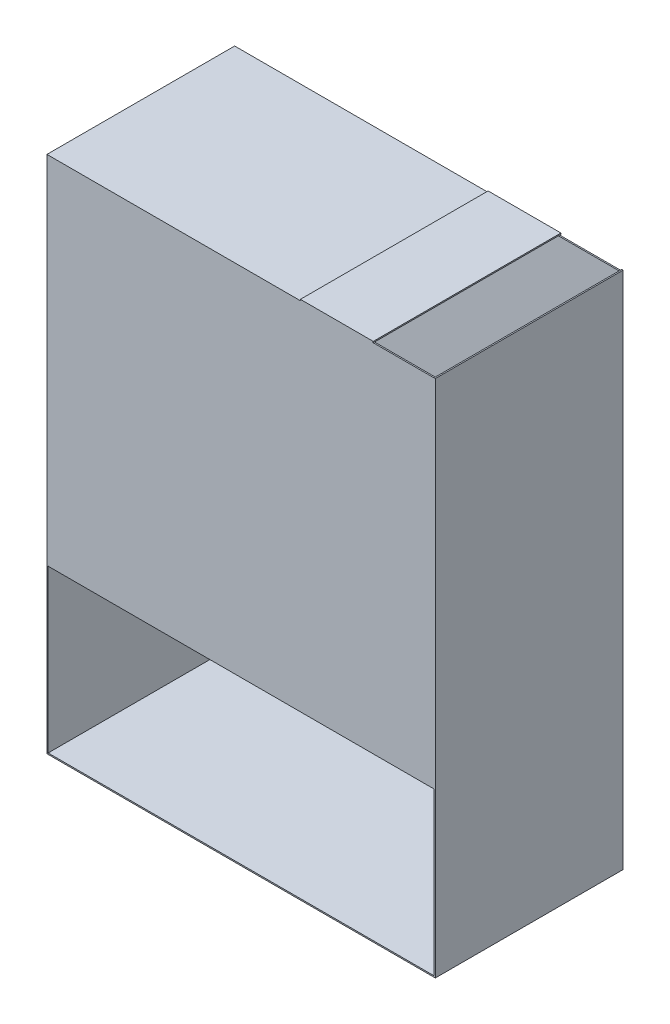
ISO-10303-21;
HEADER;
FILE_DESCRIPTION(('STEP AP214'),'2;1');
FILE_NAME('part.step','',(''),(''),'','','');
FILE_SCHEMA(('AUTOMOTIVE_DESIGN { 1 0 10303 214 1 1 1 1 }'));
ENDSEC;
DATA;
#1=APPLICATION_CONTEXT('core data for automotive mechanical design processes');
#2=APPLICATION_PROTOCOL_DEFINITION('international standard','automotive_design',2000,#1);
#3=PRODUCT_CONTEXT('',#1,'mechanical');
#4=PRODUCT('Part','Part','',(#3));
#5=PRODUCT_RELATED_PRODUCT_CATEGORY('part','',(#4));
#6=PRODUCT_DEFINITION_FORMATION('','',#4);
#7=PRODUCT_DEFINITION_CONTEXT('part definition',#1,'design');
#8=PRODUCT_DEFINITION('design','',#6,#7);
#9=PRODUCT_DEFINITION_SHAPE('','',#8);
#10=(LENGTH_UNIT() NAMED_UNIT(*) SI_UNIT(.MILLI.,.METRE.));
#11=(NAMED_UNIT(*) PLANE_ANGLE_UNIT() SI_UNIT($,.RADIAN.));
#12=(NAMED_UNIT(*) SI_UNIT($,.STERADIAN.) SOLID_ANGLE_UNIT());
#13=UNCERTAINTY_MEASURE_WITH_UNIT(LENGTH_MEASURE(1.E-05),#10,'distance_accuracy_value','');
#14=(GEOMETRIC_REPRESENTATION_CONTEXT(3) GLOBAL_UNCERTAINTY_ASSIGNED_CONTEXT((#13)) GLOBAL_UNIT_ASSIGNED_CONTEXT((#10,
#11,#12)) REPRESENTATION_CONTEXT('',''));
#15=CARTESIAN_POINT('',(0.,0.,0.));
#16=DIRECTION('',(0.,0.,1.));
#17=DIRECTION('',(1.,0.,0.));
#18=AXIS2_PLACEMENT_3D('',#15,#16,#17);
#19=CARTESIAN_POINT('',(598.,2.,290.));
#20=DIRECTION('',(1.,0.,0.));
#21=DIRECTION('',(0.,0.,-1.));
#22=AXIS2_PLACEMENT_3D('',#19,#20,#21);
#23=PLANE('',#22);
#24=DIRECTION('',(0.,0.,1.));
#25=VECTOR('',#24,1.);
#26=CARTESIAN_POINT('',(598.,251.875465041945,290.));
#27=LINE('',#26,#25);
#28=CARTESIAN_POINT('',(598.,251.875465041945,288.));
#29=VERTEX_POINT('',#28);
#30=CARTESIAN_POINT('',(598.,251.875465041945,290.));
#31=VERTEX_POINT('',#30);
#32=EDGE_CURVE('E185',#29,#31,#27,.T.);
#33=ORIENTED_EDGE('',*,*,#32,.F.);
#34=DIRECTION('',(0.,1.,0.));
#35=VECTOR('',#34,1.);
#36=CARTESIAN_POINT('',(598.,2.,288.));
#37=LINE('',#36,#35);
#38=CARTESIAN_POINT('',(598.,801.875465041945,288.));
#39=VERTEX_POINT('',#38);
#40=EDGE_CURVE('E178',#29,#39,#37,.T.);
#41=ORIENTED_EDGE('',*,*,#40,.T.);
#42=DIRECTION('',(0.,0.,1.));
#43=VECTOR('',#42,1.);
#44=CARTESIAN_POINT('',(598.,801.875465041945,290.));
#45=LINE('',#44,#43);
#46=CARTESIAN_POINT('',(598.,801.875465041945,290.));
#47=VERTEX_POINT('',#46);
#48=EDGE_CURVE('E164',#39,#47,#45,.T.);
#49=ORIENTED_EDGE('',*,*,#48,.T.);
#50=DIRECTION('',(0.,-1.,0.));
#51=VECTOR('',#50,1.);
#52=CARTESIAN_POINT('',(598.,2.,290.));
#53=LINE('',#52,#51);
#54=CARTESIAN_POINT('',(598.,802.,290.));
#55=VERTEX_POINT('',#54);
#56=EDGE_CURVE('E222',#55,#47,#53,.T.);
#57=ORIENTED_EDGE('',*,*,#56,.F.);
#58=DIRECTION('',(0.,0.,-1.));
#59=VECTOR('',#58,1.);
#60=CARTESIAN_POINT('',(598.,802.,290.));
#61=LINE('',#60,#59);
#62=CARTESIAN_POINT('',(598.,802.,0.));
#63=VERTEX_POINT('',#62);
#64=EDGE_CURVE('E288',#55,#63,#61,.T.);
#65=ORIENTED_EDGE('',*,*,#64,.T.);
#66=DIRECTION('',(0.,-1.,0.));
#67=VECTOR('',#66,1.);
#68=CARTESIAN_POINT('',(598.,2.,0.));
#69=LINE('',#68,#67);
#70=CARTESIAN_POINT('',(598.,800.,0.));
#71=VERTEX_POINT('',#70);
#72=EDGE_CURVE('E243',#63,#71,#69,.T.);
#73=ORIENTED_EDGE('',*,*,#72,.T.);
#74=DIRECTION('',(0.,0.,-1.));
#75=VECTOR('',#74,1.);
#76=CARTESIAN_POINT('',(598.,800.,0.));
#77=LINE('',#76,#75);
#78=CARTESIAN_POINT('',(598.,800.,2.));
#79=VERTEX_POINT('',#78);
#80=EDGE_CURVE('E59',#79,#71,#77,.T.);
#81=ORIENTED_EDGE('',*,*,#80,.F.);
#82=DIRECTION('',(0.,-1.,0.));
#83=VECTOR('',#82,1.);
#84=CARTESIAN_POINT('',(598.,800.,2.));
#85=LINE('',#84,#83);
#86=CARTESIAN_POINT('',(598.,2.,2.));
#87=VERTEX_POINT('',#86);
#88=EDGE_CURVE('E200',#79,#87,#85,.T.);
#89=ORIENTED_EDGE('',*,*,#88,.T.);
#90=DIRECTION('',(0.,0.,-1.));
#91=VECTOR('',#90,1.);
#92=CARTESIAN_POINT('',(598.,2.,290.));
#93=LINE('',#92,#91);
#94=CARTESIAN_POINT('',(598.,2.,290.));
#95=VERTEX_POINT('',#94);
#96=EDGE_CURVE('E285',#95,#87,#93,.T.);
#97=ORIENTED_EDGE('',*,*,#96,.F.);
#98=EDGE_CURVE('E221',#31,#95,#53,.T.);
#99=ORIENTED_EDGE('',*,*,#98,.F.);
#100=EDGE_LOOP('',(#33,#41,#49,#57,#65,#73,#81,#89,#97,#99));
#101=FACE_BOUND('',#100,.T.);
#102=ADVANCED_FACE('F36',(#101),#23,.F.);
#103=CARTESIAN_POINT('',(1.87546504194518,2.,290.));
#104=DIRECTION('',(0.,-1.,0.));
#105=DIRECTION('',(0.,0.,-1.));
#106=AXIS2_PLACEMENT_3D('',#103,#104,#105);
#107=PLANE('',#106);
#108=DIRECTION('',(1.,0.,0.));
#109=VECTOR('',#108,1.);
#110=CARTESIAN_POINT('',(1.87546504194518,2.,2.));
#111=LINE('',#110,#109);
#112=CARTESIAN_POINT('',(1.87546504194518,2.,2.));
#113=VERTEX_POINT('',#112);
#114=EDGE_CURVE('E208',#113,#87,#111,.T.);
#115=ORIENTED_EDGE('',*,*,#114,.F.);
#116=DIRECTION('',(0.,0.,-1.));
#117=VECTOR('',#116,1.);
#118=CARTESIAN_POINT('',(1.87546504194518,2.,290.));
#119=LINE('',#118,#117);
#120=CARTESIAN_POINT('',(1.87546504194518,2.,290.));
#121=VERTEX_POINT('',#120);
#122=EDGE_CURVE('E282',#121,#113,#119,.T.);
#123=ORIENTED_EDGE('',*,*,#122,.F.);
#124=DIRECTION('',(-1.,0.,0.));
#125=VECTOR('',#124,1.);
#126=CARTESIAN_POINT('',(1.87546504194518,2.,290.));
#127=LINE('',#126,#125);
#128=EDGE_CURVE('E224',#95,#121,#127,.T.);
#129=ORIENTED_EDGE('',*,*,#128,.F.);
#130=ORIENTED_EDGE('',*,*,#96,.T.);
#131=EDGE_LOOP('',(#115,#123,#129,#130));
#132=FACE_BOUND('',#131,.T.);
#133=ADVANCED_FACE('F357',(#132),#107,.F.);
#134=CARTESIAN_POINT('',(1.87546504194518,2.,290.));
#135=DIRECTION('',(-1.,0.,0.));
#136=DIRECTION('',(0.,0.,1.));
#137=AXIS2_PLACEMENT_3D('',#134,#135,#136);
#138=PLANE('',#137);
#139=DIRECTION('',(0.,0.,-1.));
#140=VECTOR('',#139,1.);
#141=CARTESIAN_POINT('',(1.87546504194518,800.,290.));
#142=LINE('',#141,#140);
#143=CARTESIAN_POINT('',(1.87546504194518,800.,288.));
#144=VERTEX_POINT('',#143);
#145=CARTESIAN_POINT('',(1.87546504194518,800.,2.));
#146=VERTEX_POINT('',#145);
#147=EDGE_CURVE('E280',#144,#146,#142,.T.);
#148=ORIENTED_EDGE('',*,*,#147,.F.);
#149=DIRECTION('',(0.,-1.,0.));
#150=VECTOR('',#149,1.);
#151=CARTESIAN_POINT('',(1.87546504194518,2.,288.));
#152=LINE('',#151,#150);
#153=CARTESIAN_POINT('',(1.87546504194518,251.875465041945,288.));
#154=VERTEX_POINT('',#153);
#155=EDGE_CURVE('E187',#144,#154,#152,.T.);
#156=ORIENTED_EDGE('',*,*,#155,.T.);
#157=DIRECTION('',(0.,0.,-1.));
#158=VECTOR('',#157,1.);
#159=CARTESIAN_POINT('',(1.87546504194518,251.875465041945,290.));
#160=LINE('',#159,#158);
#161=CARTESIAN_POINT('',(1.87546504194518,251.875465041945,290.));
#162=VERTEX_POINT('',#161);
#163=EDGE_CURVE('E172',#162,#154,#160,.T.);
#164=ORIENTED_EDGE('',*,*,#163,.F.);
#165=DIRECTION('',(0.,1.,0.));
#166=VECTOR('',#165,1.);
#167=CARTESIAN_POINT('',(1.87546504194518,2.,290.));
#168=LINE('',#167,#166);
#169=EDGE_CURVE('E226',#121,#162,#168,.T.);
#170=ORIENTED_EDGE('',*,*,#169,.F.);
#171=ORIENTED_EDGE('',*,*,#122,.T.);
#172=DIRECTION('',(0.,-1.,0.));
#173=VECTOR('',#172,1.);
#174=CARTESIAN_POINT('',(1.87546504194518,2.,2.));
#175=LINE('',#174,#173);
#176=EDGE_CURVE('E205',#146,#113,#175,.T.);
#177=ORIENTED_EDGE('',*,*,#176,.F.);
#178=EDGE_LOOP('',(#148,#156,#164,#170,#171,#177));
#179=FACE_BOUND('',#178,.T.);
#180=ADVANCED_FACE('F380',(#179),#138,.F.);
#181=CARTESIAN_POINT('',(1.87546504194518,800.,290.));
#182=DIRECTION('',(0.,1.,0.));
#183=DIRECTION('',(-1.,0.,0.));
#184=AXIS2_PLACEMENT_3D('',#181,#182,#183);
#185=PLANE('',#184);
#186=DIRECTION('',(0.,0.,-1.));
#187=VECTOR('',#186,1.);
#188=CARTESIAN_POINT('',(451.987075108766,800.,290.));
#189=LINE('',#188,#187);
#190=CARTESIAN_POINT('',(451.987075108766,800.,288.));
#191=VERTEX_POINT('',#190);
#192=CARTESIAN_POINT('',(451.987075108766,800.,2.));
#193=VERTEX_POINT('',#192);
#194=EDGE_CURVE('E278',#191,#193,#189,.T.);
#195=ORIENTED_EDGE('',*,*,#194,.F.);
#196=DIRECTION('',(-1.,0.,0.));
#197=VECTOR('',#196,1.);
#198=CARTESIAN_POINT('',(1.87546504194518,800.,288.));
#199=LINE('',#198,#197);
#200=EDGE_CURVE('E192',#191,#144,#199,.T.);
#201=ORIENTED_EDGE('',*,*,#200,.T.);
#202=ORIENTED_EDGE('',*,*,#147,.T.);
#203=DIRECTION('',(1.,0.,0.));
#204=VECTOR('',#203,1.);
#205=CARTESIAN_POINT('',(0.,800.,2.));
#206=LINE('',#205,#204);
#207=EDGE_CURVE('E189',#146,#193,#206,.T.);
#208=ORIENTED_EDGE('',*,*,#207,.T.);
#209=EDGE_LOOP('',(#195,#201,#202,#208));
#210=FACE_BOUND('',#209,.T.);
#211=ADVANCED_FACE('F376',(#210),#185,.F.);
#212=CARTESIAN_POINT('',(0.,0.,290.));
#213=DIRECTION('',(0.,1.,0.));
#214=DIRECTION('',(0.,0.,1.));
#215=AXIS2_PLACEMENT_3D('',#212,#213,#214);
#216=PLANE('',#215);
#217=DIRECTION('',(0.,0.,-1.));
#218=VECTOR('',#217,1.);
#219=CARTESIAN_POINT('',(0.,0.,290.));
#220=LINE('',#219,#218);
#221=CARTESIAN_POINT('',(0.,0.,290.));
#222=VERTEX_POINT('',#221);
#223=CARTESIAN_POINT('',(0.,0.,0.));
#224=VERTEX_POINT('',#223);
#225=EDGE_CURVE('E11',#222,#224,#220,.T.);
#226=ORIENTED_EDGE('',*,*,#225,.T.);
#227=DIRECTION('',(1.,0.,0.));
#228=VECTOR('',#227,1.);
#229=CARTESIAN_POINT('',(0.,0.,0.));
#230=LINE('',#229,#228);
#231=CARTESIAN_POINT('',(600.,0.,0.));
#232=VERTEX_POINT('',#231);
#233=EDGE_CURVE('E211',#224,#232,#230,.T.);
#234=ORIENTED_EDGE('',*,*,#233,.T.);
#235=DIRECTION('',(0.,0.,-1.));
#236=VECTOR('',#235,1.);
#237=CARTESIAN_POINT('',(600.,0.,290.));
#238=LINE('',#237,#236);
#239=CARTESIAN_POINT('',(600.,0.,290.));
#240=VERTEX_POINT('',#239);
#241=EDGE_CURVE('E44',#240,#232,#238,.T.);
#242=ORIENTED_EDGE('',*,*,#241,.F.);
#243=DIRECTION('',(1.,0.,0.));
#244=VECTOR('',#243,1.);
#245=CARTESIAN_POINT('',(0.,0.,290.));
#246=LINE('',#245,#244);
#247=EDGE_CURVE('E214',#222,#240,#246,.T.);
#248=ORIENTED_EDGE('',*,*,#247,.F.);
#249=EDGE_LOOP('',(#226,#234,#242,#248));
#250=FACE_BOUND('',#249,.T.);
#251=ADVANCED_FACE('F38',(#250),#216,.F.);
#252=CARTESIAN_POINT('',(600.,1.87180692093034,290.));
#253=DIRECTION('',(-1.,0.,0.));
#254=DIRECTION('',(0.,0.,1.));
#255=AXIS2_PLACEMENT_3D('',#252,#253,#254);
#256=PLANE('',#255);
#257=DIRECTION('',(0.,0.,-1.));
#258=VECTOR('',#257,1.);
#259=CARTESIAN_POINT('',(600.,802.,290.));
#260=LINE('',#259,#258);
#261=CARTESIAN_POINT('',(600.,802.,290.));
#262=VERTEX_POINT('',#261);
#263=CARTESIAN_POINT('',(600.,802.,0.));
#264=VERTEX_POINT('',#263);
#265=EDGE_CURVE('E291',#262,#264,#260,.T.);
#266=ORIENTED_EDGE('',*,*,#265,.F.);
#267=DIRECTION('',(0.,1.,0.));
#268=VECTOR('',#267,1.);
#269=CARTESIAN_POINT('',(600.,0.,290.));
#270=LINE('',#269,#268);
#271=EDGE_CURVE('E217',#240,#262,#270,.T.);
#272=ORIENTED_EDGE('',*,*,#271,.F.);
#273=ORIENTED_EDGE('',*,*,#241,.T.);
#274=DIRECTION('',(0.,1.,0.));
#275=VECTOR('',#274,1.);
#276=CARTESIAN_POINT('',(600.,1.87180692093034,0.));
#277=LINE('',#276,#275);
#278=EDGE_CURVE('E239',#232,#264,#277,.T.);
#279=ORIENTED_EDGE('',*,*,#278,.T.);
#280=EDGE_LOOP('',(#266,#272,#273,#279));
#281=FACE_BOUND('',#280,.T.);
#282=ADVANCED_FACE('F298',(#281),#256,.F.);
#283=CARTESIAN_POINT('',(600.,802.,290.));
#284=DIRECTION('',(0.,-1.,0.));
#285=DIRECTION('',(0.,0.,-1.));
#286=AXIS2_PLACEMENT_3D('',#283,#284,#285);
#287=PLANE('',#286);
#288=DIRECTION('',(-1.,0.,0.));
#289=VECTOR('',#288,1.);
#290=CARTESIAN_POINT('',(600.,802.,0.));
#291=LINE('',#290,#289);
#292=EDGE_CURVE('E241',#264,#63,#291,.T.);
#293=ORIENTED_EDGE('',*,*,#292,.T.);
#294=ORIENTED_EDGE('',*,*,#64,.F.);
#295=DIRECTION('',(-1.,0.,0.));
#296=VECTOR('',#295,1.);
#297=CARTESIAN_POINT('',(600.,802.,290.));
#298=LINE('',#297,#296);
#299=EDGE_CURVE('E219',#262,#55,#298,.T.);
#300=ORIENTED_EDGE('',*,*,#299,.F.);
#301=ORIENTED_EDGE('',*,*,#265,.T.);
#302=EDGE_LOOP('',(#293,#294,#300,#301));
#303=FACE_BOUND('',#302,.T.);
#304=ADVANCED_FACE('F312',(#303),#287,.F.);
#305=CARTESIAN_POINT('',(451.987075108766,801.875465041945,290.));
#306=DIRECTION('',(-1.,0.,0.));
#307=DIRECTION('',(0.,0.,1.));
#308=AXIS2_PLACEMENT_3D('',#305,#306,#307);
#309=PLANE('',#308);
#310=DIRECTION('',(0.,0.,-1.));
#311=VECTOR('',#310,1.);
#312=CARTESIAN_POINT('',(451.987075108766,801.875465041945,290.));
#313=LINE('',#312,#311);
#314=CARTESIAN_POINT('',(451.987075108766,801.875465041945,288.));
#315=VERTEX_POINT('',#314);
#316=CARTESIAN_POINT('',(451.987075108766,801.875465041945,0.));
#317=VERTEX_POINT('',#316);
#318=EDGE_CURVE('E276',#315,#317,#313,.T.);
#319=ORIENTED_EDGE('',*,*,#318,.F.);
#320=DIRECTION('',(0.,-1.,0.));
#321=VECTOR('',#320,1.);
#322=CARTESIAN_POINT('',(451.987075108766,801.875465041945,288.));
#323=LINE('',#322,#321);
#324=EDGE_CURVE('E371',#315,#191,#323,.T.);
#325=ORIENTED_EDGE('',*,*,#324,.T.);
#326=ORIENTED_EDGE('',*,*,#194,.T.);
#327=DIRECTION('',(0.,0.,-1.));
#328=VECTOR('',#327,1.);
#329=CARTESIAN_POINT('',(451.987075108766,800.,290.));
#330=LINE('',#329,#328);
#331=CARTESIAN_POINT('',(451.987075108766,800.,0.));
#332=VERTEX_POINT('',#331);
#333=EDGE_CURVE('E202',#193,#332,#330,.T.);
#334=ORIENTED_EDGE('',*,*,#333,.T.);
#335=DIRECTION('',(0.,1.,0.));
#336=VECTOR('',#335,1.);
#337=CARTESIAN_POINT('',(451.987075108766,801.875465041945,0.));
#338=LINE('',#337,#336);
#339=EDGE_CURVE('E245',#332,#317,#338,.T.);
#340=ORIENTED_EDGE('',*,*,#339,.T.);
#341=EDGE_LOOP('',(#319,#325,#326,#334,#340));
#342=FACE_BOUND('',#341,.T.);
#343=ADVANCED_FACE('F345',(#342),#309,.F.);
#344=CARTESIAN_POINT('',(451.987075108766,801.875465041945,290.));
#345=DIRECTION('',(0.,1.,0.));
#346=DIRECTION('',(0.,0.,1.));
#347=AXIS2_PLACEMENT_3D('',#344,#345,#346);
#348=PLANE('',#347);
#349=DIRECTION('',(0.,0.,-1.));
#350=VECTOR('',#349,1.);
#351=CARTESIAN_POINT('',(504.061571660139,801.875465041945,290.));
#352=LINE('',#351,#350);
#353=CARTESIAN_POINT('',(504.061571660139,801.875465041945,288.));
#354=VERTEX_POINT('',#353);
#355=CARTESIAN_POINT('',(504.061571660139,801.875465041945,0.));
#356=VERTEX_POINT('',#355);
#357=EDGE_CURVE('E272',#354,#356,#352,.T.);
#358=ORIENTED_EDGE('',*,*,#357,.F.);
#359=DIRECTION('',(-1.,0.,0.));
#360=VECTOR('',#359,1.);
#361=CARTESIAN_POINT('',(0.,801.875465041945,288.));
#362=LINE('',#361,#360);
#363=EDGE_CURVE('E181',#354,#315,#362,.T.);
#364=ORIENTED_EDGE('',*,*,#363,.T.);
#365=ORIENTED_EDGE('',*,*,#318,.T.);
#366=DIRECTION('',(1.,0.,0.));
#367=VECTOR('',#366,1.);
#368=CARTESIAN_POINT('',(451.987075108766,801.875465041945,0.));
#369=LINE('',#368,#367);
#370=EDGE_CURVE('E248',#317,#356,#369,.T.);
#371=ORIENTED_EDGE('',*,*,#370,.T.);
#372=EDGE_LOOP('',(#358,#364,#365,#371));
#373=FACE_BOUND('',#372,.T.);
#374=ADVANCED_FACE('F341',(#373),#348,.F.);
#375=CARTESIAN_POINT('',(504.061571660139,801.875465041945,290.));
#376=DIRECTION('',(-1.,0.,0.));
#377=DIRECTION('',(0.,0.,1.));
#378=AXIS2_PLACEMENT_3D('',#375,#376,#377);
#379=PLANE('',#378);
#380=DIRECTION('',(0.,1.,0.));
#381=VECTOR('',#380,1.);
#382=CARTESIAN_POINT('',(504.061571660139,801.875465041945,0.));
#383=LINE('',#382,#381);
#384=CARTESIAN_POINT('',(504.061571660139,803.75093008389,0.));
#385=VERTEX_POINT('',#384);
#386=EDGE_CURVE('E251',#356,#385,#383,.T.);
#387=ORIENTED_EDGE('',*,*,#386,.T.);
#388=DIRECTION('',(0.,0.,-1.));
#389=VECTOR('',#388,1.);
#390=CARTESIAN_POINT('',(504.061571660139,803.75093008389,290.));
#391=LINE('',#390,#389);
#392=CARTESIAN_POINT('',(504.061571660139,803.75093008389,290.));
#393=VERTEX_POINT('',#392);
#394=EDGE_CURVE('E269',#393,#385,#391,.T.);
#395=ORIENTED_EDGE('',*,*,#394,.F.);
#396=DIRECTION('',(0.,1.,0.));
#397=VECTOR('',#396,1.);
#398=CARTESIAN_POINT('',(504.061571660139,801.875465041945,290.));
#399=LINE('',#398,#397);
#400=CARTESIAN_POINT('',(504.061571660139,801.875465041945,290.));
#401=VERTEX_POINT('',#400);
#402=EDGE_CURVE('E229',#401,#393,#399,.T.);
#403=ORIENTED_EDGE('',*,*,#402,.F.);
#404=EDGE_CURVE('E273',#401,#354,#352,.T.);
#405=ORIENTED_EDGE('',*,*,#404,.T.);
#406=ORIENTED_EDGE('',*,*,#357,.T.);
#407=EDGE_LOOP('',(#387,#395,#403,#405,#406));
#408=FACE_BOUND('',#407,.T.);
#409=ADVANCED_FACE('F338',(#408),#379,.F.);
#410=CARTESIAN_POINT('',(391.533669143434,803.75093008389,290.));
#411=DIRECTION('',(0.,-1.,0.));
#412=DIRECTION('',(0.,0.,-1.));
#413=AXIS2_PLACEMENT_3D('',#410,#411,#412);
#414=PLANE('',#413);
#415=DIRECTION('',(-1.,0.,0.));
#416=VECTOR('',#415,1.);
#417=CARTESIAN_POINT('',(391.533669143434,803.75093008389,0.));
#418=LINE('',#417,#416);
#419=CARTESIAN_POINT('',(391.533669143434,803.75093008389,0.));
#420=VERTEX_POINT('',#419);
#421=EDGE_CURVE('E253',#385,#420,#418,.T.);
#422=ORIENTED_EDGE('',*,*,#421,.T.);
#423=DIRECTION('',(0.,0.,-1.));
#424=VECTOR('',#423,1.);
#425=CARTESIAN_POINT('',(391.533669143434,803.75093008389,290.));
#426=LINE('',#425,#424);
#427=CARTESIAN_POINT('',(391.533669143434,803.75093008389,290.));
#428=VERTEX_POINT('',#427);
#429=EDGE_CURVE('E266',#428,#420,#426,.T.);
#430=ORIENTED_EDGE('',*,*,#429,.F.);
#431=DIRECTION('',(-1.,0.,0.));
#432=VECTOR('',#431,1.);
#433=CARTESIAN_POINT('',(391.533669143434,803.75093008389,290.));
#434=LINE('',#433,#432);
#435=EDGE_CURVE('E231',#393,#428,#434,.T.);
#436=ORIENTED_EDGE('',*,*,#435,.F.);
#437=ORIENTED_EDGE('',*,*,#394,.T.);
#438=EDGE_LOOP('',(#422,#430,#436,#437));
#439=FACE_BOUND('',#438,.T.);
#440=ADVANCED_FACE('F333',(#439),#414,.F.);
#441=CARTESIAN_POINT('',(391.533669143434,801.875465041945,290.));
#442=DIRECTION('',(1.,0.,0.));
#443=DIRECTION('',(0.,0.,-1.));
#444=AXIS2_PLACEMENT_3D('',#441,#442,#443);
#445=PLANE('',#444);
#446=DIRECTION('',(0.,-1.,0.));
#447=VECTOR('',#446,1.);
#448=CARTESIAN_POINT('',(391.533669143434,801.875465041945,0.));
#449=LINE('',#448,#447);
#450=CARTESIAN_POINT('',(391.533669143434,801.875465041945,0.));
#451=VERTEX_POINT('',#450);
#452=EDGE_CURVE('E255',#420,#451,#449,.T.);
#453=ORIENTED_EDGE('',*,*,#452,.T.);
#454=DIRECTION('',(0.,0.,-1.));
#455=VECTOR('',#454,1.);
#456=CARTESIAN_POINT('',(391.533669143434,801.875465041945,290.));
#457=LINE('',#456,#455);
#458=CARTESIAN_POINT('',(391.533669143434,801.875465041945,290.));
#459=VERTEX_POINT('',#458);
#460=EDGE_CURVE('E264',#459,#451,#457,.T.);
#461=ORIENTED_EDGE('',*,*,#460,.F.);
#462=DIRECTION('',(0.,-1.,0.));
#463=VECTOR('',#462,1.);
#464=CARTESIAN_POINT('',(391.533669143434,801.875465041945,290.));
#465=LINE('',#464,#463);
#466=EDGE_CURVE('E233',#428,#459,#465,.T.);
#467=ORIENTED_EDGE('',*,*,#466,.F.);
#468=ORIENTED_EDGE('',*,*,#429,.T.);
#469=EDGE_LOOP('',(#453,#461,#467,#468));
#470=FACE_BOUND('',#469,.T.);
#471=ADVANCED_FACE('F328',(#470),#445,.F.);
#472=CARTESIAN_POINT('',(0.,801.875465041945,290.));
#473=DIRECTION('',(0.,-1.,0.));
#474=DIRECTION('',(0.,0.,-1.));
#475=AXIS2_PLACEMENT_3D('',#472,#473,#474);
#476=PLANE('',#475);
#477=DIRECTION('',(-1.,0.,0.));
#478=VECTOR('',#477,1.);
#479=CARTESIAN_POINT('',(0.,801.875465041945,0.));
#480=LINE('',#479,#478);
#481=CARTESIAN_POINT('',(0.,801.875465041945,0.));
#482=VERTEX_POINT('',#481);
#483=EDGE_CURVE('E258',#451,#482,#480,.T.);
#484=ORIENTED_EDGE('',*,*,#483,.T.);
#485=DIRECTION('',(0.,0.,-1.));
#486=VECTOR('',#485,1.);
#487=CARTESIAN_POINT('',(0.,801.875465041945,290.));
#488=LINE('',#487,#486);
#489=CARTESIAN_POINT('',(0.,801.875465041945,290.));
#490=VERTEX_POINT('',#489);
#491=EDGE_CURVE('E237',#490,#482,#488,.T.);
#492=ORIENTED_EDGE('',*,*,#491,.F.);
#493=DIRECTION('',(-1.,0.,0.));
#494=VECTOR('',#493,1.);
#495=CARTESIAN_POINT('',(1.87546504194508,801.875465041945,290.));
#496=LINE('',#495,#494);
#497=EDGE_CURVE('E235',#459,#490,#496,.T.);
#498=ORIENTED_EDGE('',*,*,#497,.F.);
#499=ORIENTED_EDGE('',*,*,#460,.T.);
#500=EDGE_LOOP('',(#484,#492,#498,#499));
#501=FACE_BOUND('',#500,.T.);
#502=ADVANCED_FACE('F322',(#501),#476,.F.);
#503=CARTESIAN_POINT('',(0.,1.87546504194509,290.));
#504=DIRECTION('',(1.,0.,0.));
#505=DIRECTION('',(0.,0.,-1.));
#506=AXIS2_PLACEMENT_3D('',#503,#504,#505);
#507=PLANE('',#506);
#508=ORIENTED_EDGE('',*,*,#491,.T.);
#509=DIRECTION('',(0.,-1.,0.));
#510=VECTOR('',#509,1.);
#511=CARTESIAN_POINT('',(0.,1.87546504194509,0.));
#512=LINE('',#511,#510);
#513=EDGE_CURVE('E215',#482,#224,#512,.T.);
#514=ORIENTED_EDGE('',*,*,#513,.T.);
#515=ORIENTED_EDGE('',*,*,#225,.F.);
#516=DIRECTION('',(0.,-1.,0.));
#517=VECTOR('',#516,1.);
#518=CARTESIAN_POINT('',(0.,0.,290.));
#519=LINE('',#518,#517);
#520=EDGE_CURVE('E212',#490,#222,#519,.T.);
#521=ORIENTED_EDGE('',*,*,#520,.F.);
#522=EDGE_LOOP('',(#508,#514,#515,#521));
#523=FACE_BOUND('',#522,.T.);
#524=ADVANCED_FACE('F320',(#523),#507,.F.);
#525=CARTESIAN_POINT('',(0.,0.,290.));
#526=DIRECTION('',(0.,0.,-1.));
#527=DIRECTION('',(-1.,0.,0.));
#528=AXIS2_PLACEMENT_3D('',#525,#526,#527);
#529=PLANE('',#528);
#530=DIRECTION('',(1.,0.,0.));
#531=VECTOR('',#530,1.);
#532=CARTESIAN_POINT('',(0.,251.875465041945,290.));
#533=LINE('',#532,#531);
#534=EDGE_CURVE('E173',#162,#31,#533,.T.);
#535=ORIENTED_EDGE('',*,*,#534,.T.);
#536=ORIENTED_EDGE('',*,*,#98,.T.);
#537=ORIENTED_EDGE('',*,*,#128,.T.);
#538=ORIENTED_EDGE('',*,*,#169,.T.);
#539=EDGE_LOOP('',(#535,#536,#537,#538));
#540=FACE_BOUND('',#539,.T.);
#541=ORIENTED_EDGE('',*,*,#56,.T.);
#542=DIRECTION('',(1.,0.,0.));
#543=VECTOR('',#542,1.);
#544=CARTESIAN_POINT('',(0.,801.875465041945,290.));
#545=LINE('',#544,#543);
#546=EDGE_CURVE('E51',#401,#47,#545,.T.);
#547=ORIENTED_EDGE('',*,*,#546,.F.);
#548=ORIENTED_EDGE('',*,*,#402,.T.);
#549=ORIENTED_EDGE('',*,*,#435,.T.);
#550=ORIENTED_EDGE('',*,*,#466,.T.);
#551=ORIENTED_EDGE('',*,*,#497,.T.);
#552=ORIENTED_EDGE('',*,*,#520,.T.);
#553=ORIENTED_EDGE('',*,*,#247,.T.);
#554=ORIENTED_EDGE('',*,*,#271,.T.);
#555=ORIENTED_EDGE('',*,*,#299,.T.);
#556=EDGE_LOOP('',(#541,#547,#548,#549,#550,#551,#552,#553,#554,#555));
#557=FACE_BOUND('',#556,.T.);
#558=ADVANCED_FACE('F315',(#540,#557),#529,.F.);
#559=CARTESIAN_POINT('',(0.,0.,0.));
#560=DIRECTION('',(0.,0.,-1.));
#561=DIRECTION('',(-1.,0.,0.));
#562=AXIS2_PLACEMENT_3D('',#559,#560,#561);
#563=PLANE('',#562);
#564=ORIENTED_EDGE('',*,*,#278,.F.);
#565=ORIENTED_EDGE('',*,*,#233,.F.);
#566=ORIENTED_EDGE('',*,*,#513,.F.);
#567=ORIENTED_EDGE('',*,*,#483,.F.);
#568=ORIENTED_EDGE('',*,*,#452,.F.);
#569=ORIENTED_EDGE('',*,*,#421,.F.);
#570=ORIENTED_EDGE('',*,*,#386,.F.);
#571=ORIENTED_EDGE('',*,*,#370,.F.);
#572=ORIENTED_EDGE('',*,*,#339,.F.);
#573=DIRECTION('',(-1.,0.,0.));
#574=VECTOR('',#573,1.);
#575=CARTESIAN_POINT('',(0.,800.,0.));
#576=LINE('',#575,#574);
#577=EDGE_CURVE('E197',#71,#332,#576,.T.);
#578=ORIENTED_EDGE('',*,*,#577,.F.);
#579=ORIENTED_EDGE('',*,*,#72,.F.);
#580=ORIENTED_EDGE('',*,*,#292,.F.);
#581=EDGE_LOOP('',(#564,#565,#566,#567,#568,#569,#570,#571,#572,#578,#579,#580));
#582=FACE_BOUND('',#581,.T.);
#583=ADVANCED_FACE('F307',(#582),#563,.T.);
#584=CARTESIAN_POINT('',(0.,800.,2.));
#585=DIRECTION('',(0.,0.,-1.));
#586=DIRECTION('',(-1.,0.,0.));
#587=AXIS2_PLACEMENT_3D('',#584,#585,#586);
#588=PLANE('',#587);
#589=ORIENTED_EDGE('',*,*,#176,.T.);
#590=ORIENTED_EDGE('',*,*,#114,.T.);
#591=ORIENTED_EDGE('',*,*,#88,.F.);
#592=EDGE_CURVE('E186',#193,#79,#206,.T.);
#593=ORIENTED_EDGE('',*,*,#592,.F.);
#594=ORIENTED_EDGE('',*,*,#207,.F.);
#595=EDGE_LOOP('',(#589,#590,#591,#593,#594));
#596=FACE_BOUND('',#595,.T.);
#597=ADVANCED_FACE('F353',(#596),#588,.F.);
#598=CARTESIAN_POINT('',(0.,800.,0.));
#599=DIRECTION('',(0.,1.,0.));
#600=DIRECTION('',(0.,0.,1.));
#601=AXIS2_PLACEMENT_3D('',#598,#599,#600);
#602=PLANE('',#601);
#603=ORIENTED_EDGE('',*,*,#333,.F.);
#604=ORIENTED_EDGE('',*,*,#592,.T.);
#605=ORIENTED_EDGE('',*,*,#80,.T.);
#606=ORIENTED_EDGE('',*,*,#577,.T.);
#607=EDGE_LOOP('',(#603,#604,#605,#606));
#608=FACE_BOUND('',#607,.T.);
#609=ADVANCED_FACE('F348',(#608),#602,.T.);
#610=CARTESIAN_POINT('',(0.,251.875465041945,288.));
#611=DIRECTION('',(0.,0.,-1.));
#612=DIRECTION('',(-1.,0.,0.));
#613=AXIS2_PLACEMENT_3D('',#610,#611,#612);
#614=PLANE('',#613);
#615=ORIENTED_EDGE('',*,*,#40,.F.);
#616=DIRECTION('',(-1.,0.,0.));
#617=VECTOR('',#616,1.);
#618=CARTESIAN_POINT('',(0.,251.875465041945,288.));
#619=LINE('',#618,#617);
#620=EDGE_CURVE('E364',#29,#154,#619,.T.);
#621=ORIENTED_EDGE('',*,*,#620,.T.);
#622=ORIENTED_EDGE('',*,*,#155,.F.);
#623=ORIENTED_EDGE('',*,*,#200,.F.);
#624=ORIENTED_EDGE('',*,*,#324,.F.);
#625=ORIENTED_EDGE('',*,*,#363,.F.);
#626=EDGE_CURVE('E167',#39,#354,#362,.T.);
#627=ORIENTED_EDGE('',*,*,#626,.F.);
#628=EDGE_LOOP('',(#615,#621,#622,#623,#624,#625,#627));
#629=FACE_BOUND('',#628,.T.);
#630=ADVANCED_FACE('F176',(#629),#614,.T.);
#631=CARTESIAN_POINT('',(0.,251.875465041945,0.));
#632=DIRECTION('',(0.,1.,0.));
#633=DIRECTION('',(0.,0.,1.));
#634=AXIS2_PLACEMENT_3D('',#631,#632,#633);
#635=PLANE('',#634);
#636=ORIENTED_EDGE('',*,*,#620,.F.);
#637=ORIENTED_EDGE('',*,*,#32,.T.);
#638=ORIENTED_EDGE('',*,*,#534,.F.);
#639=ORIENTED_EDGE('',*,*,#163,.T.);
#640=EDGE_LOOP('',(#636,#637,#638,#639));
#641=FACE_BOUND('',#640,.T.);
#642=ADVANCED_FACE('F381',(#641),#635,.F.);
#643=CARTESIAN_POINT('',(0.,801.875465041945,0.));
#644=DIRECTION('',(0.,1.,0.));
#645=DIRECTION('',(0.,0.,1.));
#646=AXIS2_PLACEMENT_3D('',#643,#644,#645);
#647=PLANE('',#646);
#648=ORIENTED_EDGE('',*,*,#48,.F.);
#649=ORIENTED_EDGE('',*,*,#626,.T.);
#650=ORIENTED_EDGE('',*,*,#404,.F.);
#651=ORIENTED_EDGE('',*,*,#546,.T.);
#652=EDGE_LOOP('',(#648,#649,#650,#651));
#653=FACE_BOUND('',#652,.T.);
#654=ADVANCED_FACE('F166',(#653),#647,.T.);
#655=CLOSED_SHELL('',(#102,#133,#180,#211,#251,#282,#304,#343,#374,#409,#440,#471,#502,#524,
#558,#583,#597,#609,#630,#642,#654));
#656=MANIFOLD_SOLID_BREP('B2',#655);
#657=ADVANCED_BREP_SHAPE_REPRESENTATION('',(#18,#656),#14);
#658=SHAPE_DEFINITION_REPRESENTATION(#9,#657);
ENDSEC;
END-ISO-10303-21;
